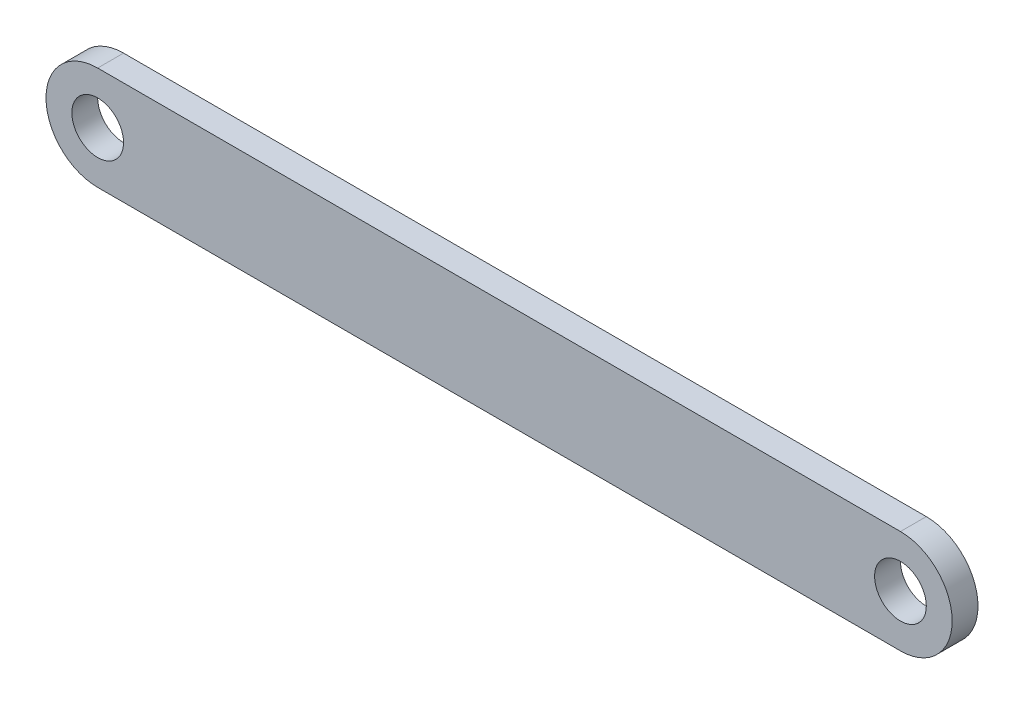
ISO-10303-21;
HEADER;
FILE_DESCRIPTION(('STEP AP214'),'2;1');
FILE_NAME('part.step','',(''),(''),'','','');
FILE_SCHEMA(('AUTOMOTIVE_DESIGN { 1 0 10303 214 1 1 1 1 }'));
ENDSEC;
DATA;
#1=APPLICATION_CONTEXT('core data for automotive mechanical design processes');
#2=APPLICATION_PROTOCOL_DEFINITION('international standard','automotive_design',2000,#1);
#3=PRODUCT_CONTEXT('',#1,'mechanical');
#4=PRODUCT('Part','Part','',(#3));
#5=PRODUCT_RELATED_PRODUCT_CATEGORY('part','',(#4));
#6=PRODUCT_DEFINITION_FORMATION('','',#4);
#7=PRODUCT_DEFINITION_CONTEXT('part definition',#1,'design');
#8=PRODUCT_DEFINITION('design','',#6,#7);
#9=PRODUCT_DEFINITION_SHAPE('','',#8);
#10=(LENGTH_UNIT() NAMED_UNIT(*) SI_UNIT(.MILLI.,.METRE.));
#11=(NAMED_UNIT(*) PLANE_ANGLE_UNIT() SI_UNIT($,.RADIAN.));
#12=(NAMED_UNIT(*) SI_UNIT($,.STERADIAN.) SOLID_ANGLE_UNIT());
#13=UNCERTAINTY_MEASURE_WITH_UNIT(LENGTH_MEASURE(1.E-05),#10,'distance_accuracy_value','');
#14=(GEOMETRIC_REPRESENTATION_CONTEXT(3) GLOBAL_UNCERTAINTY_ASSIGNED_CONTEXT((#13)) GLOBAL_UNIT_ASSIGNED_CONTEXT((#10,
#11,#12)) REPRESENTATION_CONTEXT('',''));
#15=CARTESIAN_POINT('',(0.,0.,0.));
#16=DIRECTION('',(0.,0.,1.));
#17=DIRECTION('',(1.,0.,0.));
#18=AXIS2_PLACEMENT_3D('',#15,#16,#17);
#19=CARTESIAN_POINT('',(0.,0.,1.));
#20=DIRECTION('',(0.,0.,1.));
#21=DIRECTION('',(1.,0.,0.));
#22=AXIS2_PLACEMENT_3D('',#19,#20,#21);
#23=PLANE('',#22);
#24=CARTESIAN_POINT('',(0.,0.,1.));
#25=DIRECTION('',(0.,0.,1.));
#26=DIRECTION('',(1.,0.,0.));
#27=AXIS2_PLACEMENT_3D('',#24,#25,#26);
#28=CIRCLE('',#27,1.);
#29=CARTESIAN_POINT('',(1.,0.,1.));
#30=VERTEX_POINT('',#29);
#31=EDGE_CURVE('E100',#30,#30,#28,.T.);
#32=ORIENTED_EDGE('',*,*,#31,.F.);
#33=EDGE_LOOP('',(#32));
#34=FACE_BOUND('',#33,.T.);
#35=CARTESIAN_POINT('',(0.,0.,1.));
#36=DIRECTION('',(0.,0.,1.));
#37=DIRECTION('',(1.,0.,0.));
#38=AXIS2_PLACEMENT_3D('',#35,#36,#37);
#39=CIRCLE('',#38,2.);
#40=CARTESIAN_POINT('',(0.,2.,1.));
#41=VERTEX_POINT('',#40);
#42=CARTESIAN_POINT('',(0.,-2.,1.));
#43=VERTEX_POINT('',#42);
#44=EDGE_CURVE('E85',#41,#43,#39,.T.);
#45=ORIENTED_EDGE('',*,*,#44,.T.);
#46=DIRECTION('',(1.,0.,0.));
#47=VECTOR('',#46,1.);
#48=CARTESIAN_POINT('',(0.,-2.,1.));
#49=LINE('',#48,#47);
#50=CARTESIAN_POINT('',(31.0571779122923,-2.,1.));
#51=VERTEX_POINT('',#50);
#52=EDGE_CURVE('E80',#43,#51,#49,.T.);
#53=ORIENTED_EDGE('',*,*,#52,.T.);
#54=CARTESIAN_POINT('',(31.0571779122923,0.,1.));
#55=DIRECTION('',(0.,0.,1.));
#56=DIRECTION('',(1.,0.,0.));
#57=AXIS2_PLACEMENT_3D('',#54,#55,#56);
#58=CIRCLE('',#57,2.);
#59=CARTESIAN_POINT('',(31.0571779122923,2.,1.));
#60=VERTEX_POINT('',#59);
#61=EDGE_CURVE('E83',#51,#60,#58,.T.);
#62=ORIENTED_EDGE('',*,*,#61,.T.);
#63=DIRECTION('',(-1.,0.,0.));
#64=VECTOR('',#63,1.);
#65=CARTESIAN_POINT('',(31.0571779122923,2.,1.));
#66=LINE('',#65,#64);
#67=EDGE_CURVE('E50',#60,#41,#66,.T.);
#68=ORIENTED_EDGE('',*,*,#67,.T.);
#69=EDGE_LOOP('',(#45,#53,#62,#68));
#70=FACE_BOUND('',#69,.T.);
#71=CARTESIAN_POINT('',(31.0571779122923,0.,1.));
#72=DIRECTION('',(0.,0.,1.));
#73=DIRECTION('',(1.,0.,0.));
#74=AXIS2_PLACEMENT_3D('',#71,#72,#73);
#75=CIRCLE('',#74,0.999999999999998);
#76=CARTESIAN_POINT('',(32.0571779122923,0.,1.));
#77=VERTEX_POINT('',#76);
#78=EDGE_CURVE('E115',#77,#77,#75,.T.);
#79=ORIENTED_EDGE('',*,*,#78,.F.);
#80=EDGE_LOOP('',(#79));
#81=FACE_BOUND('',#80,.T.);
#82=ADVANCED_FACE('F33',(#34,#70,#81),#23,.T.);
#83=CARTESIAN_POINT('',(0.,0.,0.));
#84=DIRECTION('',(0.,0.,1.));
#85=DIRECTION('',(1.,0.,0.));
#86=AXIS2_PLACEMENT_3D('',#83,#84,#85);
#87=PLANE('',#86);
#88=CARTESIAN_POINT('',(0.,0.,0.));
#89=DIRECTION('',(0.,0.,1.));
#90=DIRECTION('',(1.,0.,0.));
#91=AXIS2_PLACEMENT_3D('',#88,#89,#90);
#92=CIRCLE('',#91,2.);
#93=CARTESIAN_POINT('',(0.,2.,0.));
#94=VERTEX_POINT('',#93);
#95=CARTESIAN_POINT('',(0.,-2.,0.));
#96=VERTEX_POINT('',#95);
#97=EDGE_CURVE('E97',#94,#96,#92,.T.);
#98=ORIENTED_EDGE('',*,*,#97,.F.);
#99=DIRECTION('',(-1.,0.,0.));
#100=VECTOR('',#99,1.);
#101=CARTESIAN_POINT('',(31.0571779122923,2.,0.));
#102=LINE('',#101,#100);
#103=CARTESIAN_POINT('',(31.0571779122923,2.,0.));
#104=VERTEX_POINT('',#103);
#105=EDGE_CURVE('E73',#104,#94,#102,.T.);
#106=ORIENTED_EDGE('',*,*,#105,.F.);
#107=CARTESIAN_POINT('',(31.0571779122923,0.,0.));
#108=DIRECTION('',(0.,0.,1.));
#109=DIRECTION('',(1.,0.,0.));
#110=AXIS2_PLACEMENT_3D('',#107,#108,#109);
#111=CIRCLE('',#110,2.);
#112=CARTESIAN_POINT('',(31.0571779122923,-2.,0.));
#113=VERTEX_POINT('',#112);
#114=EDGE_CURVE('E67',#113,#104,#111,.T.);
#115=ORIENTED_EDGE('',*,*,#114,.F.);
#116=DIRECTION('',(1.,0.,0.));
#117=VECTOR('',#116,1.);
#118=CARTESIAN_POINT('',(0.,-2.,0.));
#119=LINE('',#118,#117);
#120=EDGE_CURVE('E89',#96,#113,#119,.T.);
#121=ORIENTED_EDGE('',*,*,#120,.F.);
#122=EDGE_LOOP('',(#98,#106,#115,#121));
#123=FACE_BOUND('',#122,.T.);
#124=CARTESIAN_POINT('',(0.,0.,0.));
#125=DIRECTION('',(0.,0.,1.));
#126=DIRECTION('',(1.,0.,0.));
#127=AXIS2_PLACEMENT_3D('',#124,#125,#126);
#128=CIRCLE('',#127,1.);
#129=CARTESIAN_POINT('',(1.,0.,0.));
#130=VERTEX_POINT('',#129);
#131=EDGE_CURVE('E112',#130,#130,#128,.T.);
#132=ORIENTED_EDGE('',*,*,#131,.T.);
#133=EDGE_LOOP('',(#132));
#134=FACE_BOUND('',#133,.T.);
#135=CARTESIAN_POINT('',(31.0571779122923,0.,0.));
#136=DIRECTION('',(0.,0.,1.));
#137=DIRECTION('',(1.,0.,0.));
#138=AXIS2_PLACEMENT_3D('',#135,#136,#137);
#139=CIRCLE('',#138,0.999999999999998);
#140=CARTESIAN_POINT('',(32.0571779122923,0.,0.));
#141=VERTEX_POINT('',#140);
#142=EDGE_CURVE('E118',#141,#141,#139,.T.);
#143=ORIENTED_EDGE('',*,*,#142,.T.);
#144=EDGE_LOOP('',(#143));
#145=FACE_BOUND('',#144,.T.);
#146=ADVANCED_FACE('F108',(#123,#134,#145),#87,.F.);
#147=CARTESIAN_POINT('',(0.,0.,1.));
#148=DIRECTION('',(0.,0.,-1.));
#149=DIRECTION('',(-1.,0.,0.));
#150=AXIS2_PLACEMENT_3D('',#147,#148,#149);
#151=CYLINDRICAL_SURFACE('',#150,2.);
#152=ORIENTED_EDGE('',*,*,#97,.T.);
#153=DIRECTION('',(0.,0.,-1.));
#154=VECTOR('',#153,1.);
#155=CARTESIAN_POINT('',(0.,-2.,1.));
#156=LINE('',#155,#154);
#157=EDGE_CURVE('E11',#43,#96,#156,.T.);
#158=ORIENTED_EDGE('',*,*,#157,.F.);
#159=ORIENTED_EDGE('',*,*,#44,.F.);
#160=DIRECTION('',(0.,0.,-1.));
#161=VECTOR('',#160,1.);
#162=CARTESIAN_POINT('',(0.,2.,1.));
#163=LINE('',#162,#161);
#164=EDGE_CURVE('E93',#41,#94,#163,.T.);
#165=ORIENTED_EDGE('',*,*,#164,.T.);
#166=EDGE_LOOP('',(#152,#158,#159,#165));
#167=FACE_BOUND('',#166,.T.);
#168=ADVANCED_FACE('F35',(#167),#151,.T.);
#169=CARTESIAN_POINT('',(0.,-2.,1.));
#170=DIRECTION('',(0.,1.,0.));
#171=DIRECTION('',(-1.,0.,0.));
#172=AXIS2_PLACEMENT_3D('',#169,#170,#171);
#173=PLANE('',#172);
#174=ORIENTED_EDGE('',*,*,#120,.T.);
#175=DIRECTION('',(0.,0.,-1.));
#176=VECTOR('',#175,1.);
#177=CARTESIAN_POINT('',(31.0571779122923,-2.,1.));
#178=LINE('',#177,#176);
#179=EDGE_CURVE('E42',#51,#113,#178,.T.);
#180=ORIENTED_EDGE('',*,*,#179,.F.);
#181=ORIENTED_EDGE('',*,*,#52,.F.);
#182=ORIENTED_EDGE('',*,*,#157,.T.);
#183=EDGE_LOOP('',(#174,#180,#181,#182));
#184=FACE_BOUND('',#183,.T.);
#185=ADVANCED_FACE('F88',(#184),#173,.F.);
#186=CARTESIAN_POINT('',(31.0571779122923,0.,1.));
#187=DIRECTION('',(0.,0.,-1.));
#188=DIRECTION('',(-1.,0.,0.));
#189=AXIS2_PLACEMENT_3D('',#186,#187,#188);
#190=CYLINDRICAL_SURFACE('',#189,2.);
#191=ORIENTED_EDGE('',*,*,#114,.T.);
#192=DIRECTION('',(0.,0.,-1.));
#193=VECTOR('',#192,1.);
#194=CARTESIAN_POINT('',(31.0571779122923,2.,1.));
#195=LINE('',#194,#193);
#196=EDGE_CURVE('E90',#60,#104,#195,.T.);
#197=ORIENTED_EDGE('',*,*,#196,.F.);
#198=ORIENTED_EDGE('',*,*,#61,.F.);
#199=ORIENTED_EDGE('',*,*,#179,.T.);
#200=EDGE_LOOP('',(#191,#197,#198,#199));
#201=FACE_BOUND('',#200,.T.);
#202=ADVANCED_FACE('F91',(#201),#190,.T.);
#203=CARTESIAN_POINT('',(31.0571779122923,2.,1.));
#204=DIRECTION('',(0.,-1.,0.));
#205=DIRECTION('',(1.,0.,0.));
#206=AXIS2_PLACEMENT_3D('',#203,#204,#205);
#207=PLANE('',#206);
#208=ORIENTED_EDGE('',*,*,#105,.T.);
#209=ORIENTED_EDGE('',*,*,#164,.F.);
#210=ORIENTED_EDGE('',*,*,#67,.F.);
#211=ORIENTED_EDGE('',*,*,#196,.T.);
#212=EDGE_LOOP('',(#208,#209,#210,#211));
#213=FACE_BOUND('',#212,.T.);
#214=ADVANCED_FACE('F105',(#213),#207,.F.);
#215=CARTESIAN_POINT('',(0.,0.,1.));
#216=DIRECTION('',(0.,0.,-1.));
#217=DIRECTION('',(-1.,0.,0.));
#218=AXIS2_PLACEMENT_3D('',#215,#216,#217);
#219=CYLINDRICAL_SURFACE('',#218,1.);
#220=ORIENTED_EDGE('',*,*,#31,.T.);
#221=EDGE_LOOP('',(#220));
#222=FACE_BOUND('',#221,.T.);
#223=ORIENTED_EDGE('',*,*,#131,.F.);
#224=EDGE_LOOP('',(#223));
#225=FACE_BOUND('',#224,.T.);
#226=ADVANCED_FACE('F135',(#222,#225),#219,.F.);
#227=CARTESIAN_POINT('',(31.0571779122923,0.,1.));
#228=DIRECTION('',(0.,0.,-1.));
#229=DIRECTION('',(-1.,0.,0.));
#230=AXIS2_PLACEMENT_3D('',#227,#228,#229);
#231=CYLINDRICAL_SURFACE('',#230,0.999999999999998);
#232=ORIENTED_EDGE('',*,*,#78,.T.);
#233=EDGE_LOOP('',(#232));
#234=FACE_BOUND('',#233,.T.);
#235=ORIENTED_EDGE('',*,*,#142,.F.);
#236=EDGE_LOOP('',(#235));
#237=FACE_BOUND('',#236,.T.);
#238=ADVANCED_FACE('F124',(#234,#237),#231,.F.);
#239=CLOSED_SHELL('',(#82,#146,#168,#185,#202,#214,#226,#238));
#240=MANIFOLD_SOLID_BREP('B2',#239);
#241=ADVANCED_BREP_SHAPE_REPRESENTATION('',(#18,#240),#14);
#242=SHAPE_DEFINITION_REPRESENTATION(#9,#241);
ENDSEC;
END-ISO-10303-21;
